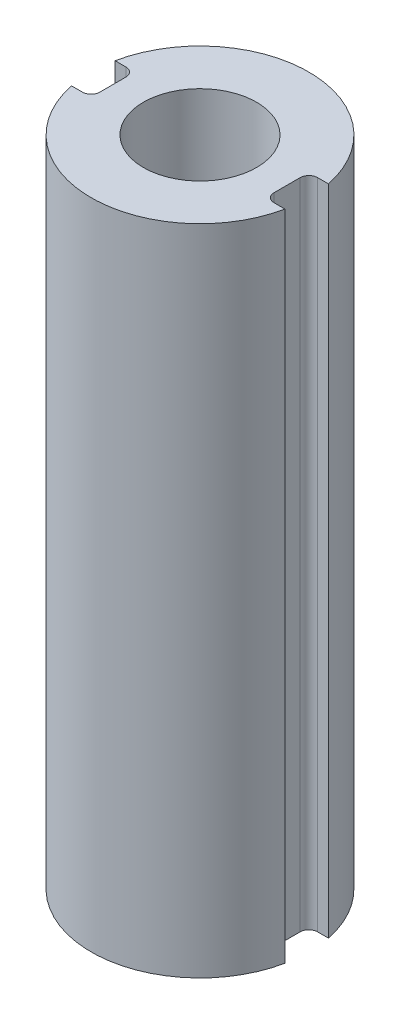
ISO-10303-21;
HEADER;
FILE_DESCRIPTION(('STEP AP214'),'2;1');
FILE_NAME('part.step','',(''),(''),'','','');
FILE_SCHEMA(('AUTOMOTIVE_DESIGN { 1 0 10303 214 1 1 1 1 }'));
ENDSEC;
DATA;
#1=APPLICATION_CONTEXT('core data for automotive mechanical design processes');
#2=APPLICATION_PROTOCOL_DEFINITION('international standard','automotive_design',2000,#1);
#3=PRODUCT_CONTEXT('',#1,'mechanical');
#4=PRODUCT('Part','Part','',(#3));
#5=PRODUCT_RELATED_PRODUCT_CATEGORY('part','',(#4));
#6=PRODUCT_DEFINITION_FORMATION('','',#4);
#7=PRODUCT_DEFINITION_CONTEXT('part definition',#1,'design');
#8=PRODUCT_DEFINITION('design','',#6,#7);
#9=PRODUCT_DEFINITION_SHAPE('','',#8);
#10=(LENGTH_UNIT() NAMED_UNIT(*) SI_UNIT(.MILLI.,.METRE.));
#11=(NAMED_UNIT(*) PLANE_ANGLE_UNIT() SI_UNIT($,.RADIAN.));
#12=(NAMED_UNIT(*) SI_UNIT($,.STERADIAN.) SOLID_ANGLE_UNIT());
#13=UNCERTAINTY_MEASURE_WITH_UNIT(LENGTH_MEASURE(1.E-05),#10,'distance_accuracy_value','');
#14=(GEOMETRIC_REPRESENTATION_CONTEXT(3) GLOBAL_UNCERTAINTY_ASSIGNED_CONTEXT((#13)) GLOBAL_UNIT_ASSIGNED_CONTEXT((#10,
#11,#12)) REPRESENTATION_CONTEXT('',''));
#15=CARTESIAN_POINT('',(0.,0.,0.));
#16=DIRECTION('',(0.,0.,1.));
#17=DIRECTION('',(1.,0.,0.));
#18=AXIS2_PLACEMENT_3D('',#15,#16,#17);
#19=CARTESIAN_POINT('',(2.54,19.05,0.634999999999999));
#20=DIRECTION('',(-1.,0.,0.));
#21=DIRECTION('',(0.,0.,1.));
#22=AXIS2_PLACEMENT_3D('',#19,#20,#21);
#23=PLANE('',#22);
#24=DIRECTION('',(0.,0.,-1.));
#25=VECTOR('',#24,1.);
#26=CARTESIAN_POINT('',(2.54,19.05,0.634999999999999));
#27=LINE('',#26,#25);
#28=CARTESIAN_POINT('',(2.54,19.05,0.381));
#29=VERTEX_POINT('',#28);
#30=CARTESIAN_POINT('',(2.54,19.05,-0.381000000000001));
#31=VERTEX_POINT('',#30);
#32=EDGE_CURVE('E136',#29,#31,#27,.T.);
#33=ORIENTED_EDGE('',*,*,#32,.F.);
#34=DIRECTION('',(0.,-1.,0.));
#35=VECTOR('',#34,1.);
#36=CARTESIAN_POINT('',(2.54,0.,0.381));
#37=LINE('',#36,#35);
#38=CARTESIAN_POINT('',(2.54,0.,0.381));
#39=VERTEX_POINT('',#38);
#40=EDGE_CURVE('E191',#29,#39,#37,.T.);
#41=ORIENTED_EDGE('',*,*,#40,.T.);
#42=DIRECTION('',(0.,0.,-1.));
#43=VECTOR('',#42,1.);
#44=CARTESIAN_POINT('',(2.54,0.,0.634999999999999));
#45=LINE('',#44,#43);
#46=CARTESIAN_POINT('',(2.54,0.,-0.381000000000001));
#47=VERTEX_POINT('',#46);
#48=EDGE_CURVE('E165',#39,#47,#45,.T.);
#49=ORIENTED_EDGE('',*,*,#48,.T.);
#50=DIRECTION('',(0.,-1.,0.));
#51=VECTOR('',#50,1.);
#52=CARTESIAN_POINT('',(2.54,19.05,-0.381000000000001));
#53=LINE('',#52,#51);
#54=EDGE_CURVE('E145',#47,#31,#53,.F.);
#55=ORIENTED_EDGE('',*,*,#54,.T.);
#56=EDGE_LOOP('',(#33,#41,#49,#55));
#57=FACE_BOUND('',#56,.T.);
#58=ADVANCED_FACE('F35',(#57),#23,.F.);
#59=CARTESIAN_POINT('',(2.54,19.05,-0.635000000000001));
#60=DIRECTION('',(0.,0.,-1.));
#61=DIRECTION('',(-1.,0.,0.));
#62=AXIS2_PLACEMENT_3D('',#59,#60,#61);
#63=PLANE('',#62);
#64=DIRECTION('',(1.,0.,0.));
#65=VECTOR('',#64,1.);
#66=CARTESIAN_POINT('',(2.54,19.05,-0.635000000000001));
#67=LINE('',#66,#65);
#68=CARTESIAN_POINT('',(2.794,19.05,-0.635000000000001));
#69=VERTEX_POINT('',#68);
#70=CARTESIAN_POINT('',(3.11085197333464,19.05,-0.635000000000001));
#71=VERTEX_POINT('',#70);
#72=EDGE_CURVE('E123',#69,#71,#67,.T.);
#73=ORIENTED_EDGE('',*,*,#72,.F.);
#74=DIRECTION('',(0.,-1.,0.));
#75=VECTOR('',#74,1.);
#76=CARTESIAN_POINT('',(2.794,0.,-0.635000000000001));
#77=LINE('',#76,#75);
#78=CARTESIAN_POINT('',(2.794,0.,-0.635000000000001));
#79=VERTEX_POINT('',#78);
#80=EDGE_CURVE('E196',#69,#79,#77,.T.);
#81=ORIENTED_EDGE('',*,*,#80,.T.);
#82=DIRECTION('',(1.,0.,0.));
#83=VECTOR('',#82,1.);
#84=CARTESIAN_POINT('',(2.54,0.,-0.635000000000001));
#85=LINE('',#84,#83);
#86=CARTESIAN_POINT('',(3.11085197333464,0.,-0.635000000000001));
#87=VERTEX_POINT('',#86);
#88=EDGE_CURVE('E142',#79,#87,#85,.T.);
#89=ORIENTED_EDGE('',*,*,#88,.T.);
#90=DIRECTION('',(0.,-1.,0.));
#91=VECTOR('',#90,1.);
#92=CARTESIAN_POINT('',(3.11085197333464,19.05,-0.635000000000001));
#93=LINE('',#92,#91);
#94=EDGE_CURVE('E139',#71,#87,#93,.T.);
#95=ORIENTED_EDGE('',*,*,#94,.F.);
#96=EDGE_LOOP('',(#73,#81,#89,#95));
#97=FACE_BOUND('',#96,.T.);
#98=ADVANCED_FACE('F140',(#97),#63,.F.);
#99=CARTESIAN_POINT('',(0.,19.05,0.));
#100=DIRECTION('',(0.,-1.,0.));
#101=DIRECTION('',(0.,0.,-1.));
#102=AXIS2_PLACEMENT_3D('',#99,#100,#101);
#103=CYLINDRICAL_SURFACE('',#102,3.175);
#104=CARTESIAN_POINT('',(0.,0.,0.));
#105=DIRECTION('',(0.,1.,0.));
#106=DIRECTION('',(0.,0.,1.));
#107=AXIS2_PLACEMENT_3D('',#104,#105,#106);
#108=CIRCLE('',#107,3.175);
#109=CARTESIAN_POINT('',(-3.11085197333464,0.,-0.635000000000001));
#110=VERTEX_POINT('',#109);
#111=EDGE_CURVE('E170',#87,#110,#108,.T.);
#112=ORIENTED_EDGE('',*,*,#111,.T.);
#113=DIRECTION('',(0.,-1.,0.));
#114=VECTOR('',#113,1.);
#115=CARTESIAN_POINT('',(-3.11085197333464,19.05,-0.635000000000001));
#116=LINE('',#115,#114);
#117=CARTESIAN_POINT('',(-3.11085197333464,19.05,-0.635000000000001));
#118=VERTEX_POINT('',#117);
#119=EDGE_CURVE('E146',#118,#110,#116,.T.);
#120=ORIENTED_EDGE('',*,*,#119,.F.);
#121=CARTESIAN_POINT('',(0.,19.05,0.));
#122=DIRECTION('',(0.,1.,0.));
#123=DIRECTION('',(0.,0.,1.));
#124=AXIS2_PLACEMENT_3D('',#121,#122,#123);
#125=CIRCLE('',#124,3.175);
#126=EDGE_CURVE('E128',#71,#118,#125,.T.);
#127=ORIENTED_EDGE('',*,*,#126,.F.);
#128=ORIENTED_EDGE('',*,*,#94,.T.);
#129=EDGE_LOOP('',(#112,#120,#127,#128));
#130=FACE_BOUND('',#129,.T.);
#131=ADVANCED_FACE('F148',(#130),#103,.T.);
#132=CARTESIAN_POINT('',(-2.54,19.05,-0.635000000000001));
#133=DIRECTION('',(0.,0.,-1.));
#134=DIRECTION('',(-1.,0.,0.));
#135=AXIS2_PLACEMENT_3D('',#132,#133,#134);
#136=PLANE('',#135);
#137=DIRECTION('',(1.,0.,0.));
#138=VECTOR('',#137,1.);
#139=CARTESIAN_POINT('',(-2.54,0.,-0.635000000000001));
#140=LINE('',#139,#138);
#141=CARTESIAN_POINT('',(-2.794,0.,-0.635000000000001));
#142=VERTEX_POINT('',#141);
#143=EDGE_CURVE('E172',#110,#142,#140,.T.);
#144=ORIENTED_EDGE('',*,*,#143,.T.);
#145=DIRECTION('',(0.,-1.,0.));
#146=VECTOR('',#145,1.);
#147=CARTESIAN_POINT('',(-2.794,19.05,-0.635000000000001));
#148=LINE('',#147,#146);
#149=CARTESIAN_POINT('',(-2.794,19.05,-0.635000000000001));
#150=VERTEX_POINT('',#149);
#151=EDGE_CURVE('E50',#142,#150,#148,.F.);
#152=ORIENTED_EDGE('',*,*,#151,.T.);
#153=DIRECTION('',(1.,0.,0.));
#154=VECTOR('',#153,1.);
#155=CARTESIAN_POINT('',(-2.54,19.05,-0.635000000000001));
#156=LINE('',#155,#154);
#157=EDGE_CURVE('E150',#118,#150,#156,.T.);
#158=ORIENTED_EDGE('',*,*,#157,.F.);
#159=ORIENTED_EDGE('',*,*,#119,.T.);
#160=EDGE_LOOP('',(#144,#152,#158,#159));
#161=FACE_BOUND('',#160,.T.);
#162=ADVANCED_FACE('F237',(#161),#136,.F.);
#163=CARTESIAN_POINT('',(-2.54,19.05,0.634999999999999));
#164=DIRECTION('',(1.,0.,0.));
#165=DIRECTION('',(0.,0.,-1.));
#166=AXIS2_PLACEMENT_3D('',#163,#164,#165);
#167=PLANE('',#166);
#168=DIRECTION('',(0.,0.,1.));
#169=VECTOR('',#168,1.);
#170=CARTESIAN_POINT('',(-2.54,0.,0.634999999999999));
#171=LINE('',#170,#169);
#172=CARTESIAN_POINT('',(-2.54,0.,-0.381000000000001));
#173=VERTEX_POINT('',#172);
#174=CARTESIAN_POINT('',(-2.54,0.,0.380999999999999));
#175=VERTEX_POINT('',#174);
#176=EDGE_CURVE('E174',#173,#175,#171,.T.);
#177=ORIENTED_EDGE('',*,*,#176,.T.);
#178=DIRECTION('',(0.,-1.,0.));
#179=VECTOR('',#178,1.);
#180=CARTESIAN_POINT('',(-2.54,19.05,0.380999999999999));
#181=LINE('',#180,#179);
#182=CARTESIAN_POINT('',(-2.54,19.05,0.380999999999999));
#183=VERTEX_POINT('',#182);
#184=EDGE_CURVE('E204',#175,#183,#181,.F.);
#185=ORIENTED_EDGE('',*,*,#184,.T.);
#186=DIRECTION('',(0.,0.,1.));
#187=VECTOR('',#186,1.);
#188=CARTESIAN_POINT('',(-2.54,19.05,0.634999999999999));
#189=LINE('',#188,#187);
#190=CARTESIAN_POINT('',(-2.54,19.05,-0.381000000000001));
#191=VERTEX_POINT('',#190);
#192=EDGE_CURVE('E152',#191,#183,#189,.T.);
#193=ORIENTED_EDGE('',*,*,#192,.F.);
#194=DIRECTION('',(0.,-1.,0.));
#195=VECTOR('',#194,1.);
#196=CARTESIAN_POINT('',(-2.54,0.,-0.381000000000001));
#197=LINE('',#196,#195);
#198=EDGE_CURVE('E201',#191,#173,#197,.T.);
#199=ORIENTED_EDGE('',*,*,#198,.T.);
#200=EDGE_LOOP('',(#177,#185,#193,#199));
#201=FACE_BOUND('',#200,.T.);
#202=ADVANCED_FACE('F233',(#201),#167,.F.);
#203=CARTESIAN_POINT('',(-2.54,19.05,0.634999999999999));
#204=DIRECTION('',(0.,0.,1.));
#205=DIRECTION('',(1.,0.,0.));
#206=AXIS2_PLACEMENT_3D('',#203,#204,#205);
#207=PLANE('',#206);
#208=DIRECTION('',(-1.,0.,0.));
#209=VECTOR('',#208,1.);
#210=CARTESIAN_POINT('',(-2.54,19.05,0.634999999999999));
#211=LINE('',#210,#209);
#212=CARTESIAN_POINT('',(-2.794,19.05,0.634999999999999));
#213=VERTEX_POINT('',#212);
#214=CARTESIAN_POINT('',(-3.11085197333464,19.05,0.635));
#215=VERTEX_POINT('',#214);
#216=EDGE_CURVE('E158',#213,#215,#211,.T.);
#217=ORIENTED_EDGE('',*,*,#216,.F.);
#218=DIRECTION('',(0.,-1.,0.));
#219=VECTOR('',#218,1.);
#220=CARTESIAN_POINT('',(-2.794,0.,0.634999999999999));
#221=LINE('',#220,#219);
#222=CARTESIAN_POINT('',(-2.794,0.,0.634999999999999));
#223=VERTEX_POINT('',#222);
#224=EDGE_CURVE('E198',#213,#223,#221,.T.);
#225=ORIENTED_EDGE('',*,*,#224,.T.);
#226=DIRECTION('',(-1.,0.,0.));
#227=VECTOR('',#226,1.);
#228=CARTESIAN_POINT('',(-2.54,0.,0.634999999999999));
#229=LINE('',#228,#227);
#230=CARTESIAN_POINT('',(-3.11085197333464,0.,0.635));
#231=VERTEX_POINT('',#230);
#232=EDGE_CURVE('E177',#223,#231,#229,.T.);
#233=ORIENTED_EDGE('',*,*,#232,.T.);
#234=DIRECTION('',(0.,-1.,0.));
#235=VECTOR('',#234,1.);
#236=CARTESIAN_POINT('',(-3.11085197333464,19.05,0.635));
#237=LINE('',#236,#235);
#238=EDGE_CURVE('E186',#215,#231,#237,.T.);
#239=ORIENTED_EDGE('',*,*,#238,.F.);
#240=EDGE_LOOP('',(#217,#225,#233,#239));
#241=FACE_BOUND('',#240,.T.);
#242=ADVANCED_FACE('F225',(#241),#207,.F.);
#243=CARTESIAN_POINT('',(0.,19.05,0.));
#244=DIRECTION('',(0.,-1.,0.));
#245=DIRECTION('',(0.,0.,-1.));
#246=AXIS2_PLACEMENT_3D('',#243,#244,#245);
#247=CYLINDRICAL_SURFACE('',#246,3.175);
#248=CARTESIAN_POINT('',(0.,0.,0.));
#249=DIRECTION('',(0.,1.,0.));
#250=DIRECTION('',(0.,0.,1.));
#251=AXIS2_PLACEMENT_3D('',#248,#249,#250);
#252=CIRCLE('',#251,3.175);
#253=CARTESIAN_POINT('',(3.11085197333464,0.,0.634999999999999));
#254=VERTEX_POINT('',#253);
#255=EDGE_CURVE('E179',#231,#254,#252,.T.);
#256=ORIENTED_EDGE('',*,*,#255,.T.);
#257=DIRECTION('',(0.,-1.,0.));
#258=VECTOR('',#257,1.);
#259=CARTESIAN_POINT('',(3.11085197333464,19.05,0.634999999999999));
#260=LINE('',#259,#258);
#261=CARTESIAN_POINT('',(3.11085197333464,19.05,0.634999999999999));
#262=VERTEX_POINT('',#261);
#263=EDGE_CURVE('E164',#262,#254,#260,.T.);
#264=ORIENTED_EDGE('',*,*,#263,.F.);
#265=CARTESIAN_POINT('',(0.,19.05,0.));
#266=DIRECTION('',(0.,1.,0.));
#267=DIRECTION('',(0.,0.,1.));
#268=AXIS2_PLACEMENT_3D('',#265,#266,#267);
#269=CIRCLE('',#268,3.175);
#270=EDGE_CURVE('E160',#215,#262,#269,.T.);
#271=ORIENTED_EDGE('',*,*,#270,.F.);
#272=ORIENTED_EDGE('',*,*,#238,.T.);
#273=EDGE_LOOP('',(#256,#264,#271,#272));
#274=FACE_BOUND('',#273,.T.);
#275=ADVANCED_FACE('F269',(#274),#247,.T.);
#276=CARTESIAN_POINT('',(2.54,19.05,0.634999999999999));
#277=DIRECTION('',(0.,0.,1.));
#278=DIRECTION('',(1.,0.,0.));
#279=AXIS2_PLACEMENT_3D('',#276,#277,#278);
#280=PLANE('',#279);
#281=DIRECTION('',(-1.,0.,0.));
#282=VECTOR('',#281,1.);
#283=CARTESIAN_POINT('',(2.54,0.,0.634999999999999));
#284=LINE('',#283,#282);
#285=CARTESIAN_POINT('',(2.794,0.,0.634999999999999));
#286=VERTEX_POINT('',#285);
#287=EDGE_CURVE('E181',#254,#286,#284,.T.);
#288=ORIENTED_EDGE('',*,*,#287,.T.);
#289=DIRECTION('',(0.,-1.,0.));
#290=VECTOR('',#289,1.);
#291=CARTESIAN_POINT('',(2.794,19.05,0.634999999999999));
#292=LINE('',#291,#290);
#293=CARTESIAN_POINT('',(2.794,19.05,0.634999999999999));
#294=VERTEX_POINT('',#293);
#295=EDGE_CURVE('E194',#286,#294,#292,.F.);
#296=ORIENTED_EDGE('',*,*,#295,.T.);
#297=DIRECTION('',(-1.,0.,0.));
#298=VECTOR('',#297,1.);
#299=CARTESIAN_POINT('',(2.54,19.05,0.634999999999999));
#300=LINE('',#299,#298);
#301=EDGE_CURVE('E162',#262,#294,#300,.T.);
#302=ORIENTED_EDGE('',*,*,#301,.F.);
#303=ORIENTED_EDGE('',*,*,#263,.T.);
#304=EDGE_LOOP('',(#288,#296,#302,#303));
#305=FACE_BOUND('',#304,.T.);
#306=ADVANCED_FACE('F272',(#305),#280,.F.);
#307=CARTESIAN_POINT('',(0.,19.05,0.));
#308=DIRECTION('',(0.,1.,0.));
#309=DIRECTION('',(0.,0.,1.));
#310=AXIS2_PLACEMENT_3D('',#307,#308,#309);
#311=PLANE('',#310);
#312=CARTESIAN_POINT('',(0.,19.05,0.));
#313=DIRECTION('',(0.,1.,0.));
#314=DIRECTION('',(0.,0.,1.));
#315=AXIS2_PLACEMENT_3D('',#312,#313,#314);
#316=CIRCLE('',#315,1.651);
#317=CARTESIAN_POINT('',(0.,19.05,1.651));
#318=VERTEX_POINT('',#317);
#319=EDGE_CURVE('E292',#318,#318,#316,.T.);
#320=ORIENTED_EDGE('',*,*,#319,.F.);
#321=EDGE_LOOP('',(#320));
#322=FACE_BOUND('',#321,.T.);
#323=ORIENTED_EDGE('',*,*,#301,.T.);
#324=CARTESIAN_POINT('',(2.794,19.05,0.381));
#325=DIRECTION('',(0.,1.,0.));
#326=DIRECTION('',(0.,0.,1.));
#327=AXIS2_PLACEMENT_3D('',#324,#325,#326);
#328=CIRCLE('',#327,0.254);
#329=EDGE_CURVE('E209',#294,#29,#328,.F.);
#330=ORIENTED_EDGE('',*,*,#329,.T.);
#331=ORIENTED_EDGE('',*,*,#32,.T.);
#332=CARTESIAN_POINT('',(2.794,19.05,-0.381000000000001));
#333=DIRECTION('',(0.,1.,0.));
#334=DIRECTION('',(0.,0.,1.));
#335=AXIS2_PLACEMENT_3D('',#332,#333,#334);
#336=CIRCLE('',#335,0.254);
#337=EDGE_CURVE('E132',#31,#69,#336,.F.);
#338=ORIENTED_EDGE('',*,*,#337,.T.);
#339=ORIENTED_EDGE('',*,*,#72,.T.);
#340=ORIENTED_EDGE('',*,*,#126,.T.);
#341=ORIENTED_EDGE('',*,*,#157,.T.);
#342=CARTESIAN_POINT('',(-2.794,19.05,-0.381000000000001));
#343=DIRECTION('',(0.,1.,0.));
#344=DIRECTION('',(0.,0.,1.));
#345=AXIS2_PLACEMENT_3D('',#342,#343,#344);
#346=CIRCLE('',#345,0.254);
#347=EDGE_CURVE('E11',#150,#191,#346,.F.);
#348=ORIENTED_EDGE('',*,*,#347,.T.);
#349=ORIENTED_EDGE('',*,*,#192,.T.);
#350=CARTESIAN_POINT('',(-2.794,19.05,0.380999999999999));
#351=DIRECTION('',(0.,1.,0.));
#352=DIRECTION('',(0.,0.,1.));
#353=AXIS2_PLACEMENT_3D('',#350,#351,#352);
#354=CIRCLE('',#353,0.254);
#355=EDGE_CURVE('E216',#183,#213,#354,.F.);
#356=ORIENTED_EDGE('',*,*,#355,.T.);
#357=ORIENTED_EDGE('',*,*,#216,.T.);
#358=ORIENTED_EDGE('',*,*,#270,.T.);
#359=EDGE_LOOP('',(#323,#330,#331,#338,#339,#340,#341,#348,#349,#356,#357,#358));
#360=FACE_BOUND('',#359,.T.);
#361=ADVANCED_FACE('F126',(#322,#360),#311,.T.);
#362=CARTESIAN_POINT('',(0.,0.,0.));
#363=DIRECTION('',(0.,1.,0.));
#364=DIRECTION('',(0.,0.,1.));
#365=AXIS2_PLACEMENT_3D('',#362,#363,#364);
#366=PLANE('',#365);
#367=ORIENTED_EDGE('',*,*,#48,.F.);
#368=CARTESIAN_POINT('',(2.794,0.,0.381));
#369=DIRECTION('',(0.,1.,0.));
#370=DIRECTION('',(0.,0.,1.));
#371=AXIS2_PLACEMENT_3D('',#368,#369,#370);
#372=CIRCLE('',#371,0.254);
#373=EDGE_CURVE('E207',#39,#286,#372,.T.);
#374=ORIENTED_EDGE('',*,*,#373,.T.);
#375=ORIENTED_EDGE('',*,*,#287,.F.);
#376=ORIENTED_EDGE('',*,*,#255,.F.);
#377=ORIENTED_EDGE('',*,*,#232,.F.);
#378=CARTESIAN_POINT('',(-2.794,0.,0.380999999999999));
#379=DIRECTION('',(0.,1.,0.));
#380=DIRECTION('',(0.,0.,1.));
#381=AXIS2_PLACEMENT_3D('',#378,#379,#380);
#382=CIRCLE('',#381,0.254);
#383=EDGE_CURVE('E214',#223,#175,#382,.T.);
#384=ORIENTED_EDGE('',*,*,#383,.T.);
#385=ORIENTED_EDGE('',*,*,#176,.F.);
#386=CARTESIAN_POINT('',(-2.794,0.,-0.381000000000001));
#387=DIRECTION('',(0.,1.,0.));
#388=DIRECTION('',(0.,0.,1.));
#389=AXIS2_PLACEMENT_3D('',#386,#387,#388);
#390=CIRCLE('',#389,0.254);
#391=EDGE_CURVE('E43',#173,#142,#390,.T.);
#392=ORIENTED_EDGE('',*,*,#391,.T.);
#393=ORIENTED_EDGE('',*,*,#143,.F.);
#394=ORIENTED_EDGE('',*,*,#111,.F.);
#395=ORIENTED_EDGE('',*,*,#88,.F.);
#396=CARTESIAN_POINT('',(2.794,0.,-0.381000000000001));
#397=DIRECTION('',(0.,1.,0.));
#398=DIRECTION('',(0.,0.,1.));
#399=AXIS2_PLACEMENT_3D('',#396,#397,#398);
#400=CIRCLE('',#399,0.254);
#401=EDGE_CURVE('E211',#79,#47,#400,.T.);
#402=ORIENTED_EDGE('',*,*,#401,.T.);
#403=EDGE_LOOP('',(#367,#374,#375,#376,#377,#384,#385,#392,#393,#394,#395,#402));
#404=FACE_BOUND('',#403,.T.);
#405=ADVANCED_FACE('F230',(#404),#366,.F.);
#406=CARTESIAN_POINT('',(0.,6.35,0.));
#407=DIRECTION('',(0.,1.,0.));
#408=DIRECTION('',(0.,0.,1.));
#409=AXIS2_PLACEMENT_3D('',#406,#407,#408);
#410=CYLINDRICAL_SURFACE('',#409,1.651);
#411=CARTESIAN_POINT('',(0.,6.35,0.));
#412=DIRECTION('',(0.,1.,0.));
#413=DIRECTION('',(0.,0.,1.));
#414=AXIS2_PLACEMENT_3D('',#411,#412,#413);
#415=CIRCLE('',#414,1.651);
#416=CARTESIAN_POINT('',(0.,6.35,1.651));
#417=VERTEX_POINT('',#416);
#418=EDGE_CURVE('E168',#417,#417,#415,.T.);
#419=ORIENTED_EDGE('',*,*,#418,.F.);
#420=EDGE_LOOP('',(#419));
#421=FACE_BOUND('',#420,.T.);
#422=ORIENTED_EDGE('',*,*,#319,.T.);
#423=EDGE_LOOP('',(#422));
#424=FACE_BOUND('',#423,.T.);
#425=ADVANCED_FACE('F279',(#421,#424),#410,.F.);
#426=CARTESIAN_POINT('',(0.,6.35,0.));
#427=DIRECTION('',(0.,1.,0.));
#428=DIRECTION('',(0.,0.,1.));
#429=AXIS2_PLACEMENT_3D('',#426,#427,#428);
#430=PLANE('',#429);
#431=ORIENTED_EDGE('',*,*,#418,.T.);
#432=EDGE_LOOP('',(#431));
#433=FACE_BOUND('',#432,.T.);
#434=ADVANCED_FACE('F251',(#433),#430,.T.);
#435=CARTESIAN_POINT('',(2.794,19.05,0.381));
#436=DIRECTION('',(0.,1.,0.));
#437=DIRECTION('',(0.,0.,1.));
#438=AXIS2_PLACEMENT_3D('',#435,#436,#437);
#439=CYLINDRICAL_SURFACE('',#438,0.254);
#440=ORIENTED_EDGE('',*,*,#329,.F.);
#441=ORIENTED_EDGE('',*,*,#295,.F.);
#442=ORIENTED_EDGE('',*,*,#373,.F.);
#443=ORIENTED_EDGE('',*,*,#40,.F.);
#444=EDGE_LOOP('',(#440,#441,#442,#443));
#445=FACE_BOUND('',#444,.T.);
#446=ADVANCED_FACE('F245',(#445),#439,.F.);
#447=CARTESIAN_POINT('',(2.794,19.05,-0.381000000000001));
#448=DIRECTION('',(0.,1.,0.));
#449=DIRECTION('',(0.,0.,1.));
#450=AXIS2_PLACEMENT_3D('',#447,#448,#449);
#451=CYLINDRICAL_SURFACE('',#450,0.254);
#452=ORIENTED_EDGE('',*,*,#337,.F.);
#453=ORIENTED_EDGE('',*,*,#54,.F.);
#454=ORIENTED_EDGE('',*,*,#401,.F.);
#455=ORIENTED_EDGE('',*,*,#80,.F.);
#456=EDGE_LOOP('',(#452,#453,#454,#455));
#457=FACE_BOUND('',#456,.T.);
#458=ADVANCED_FACE('F243',(#457),#451,.F.);
#459=CARTESIAN_POINT('',(-2.794,19.05,0.380999999999999));
#460=DIRECTION('',(0.,1.,0.));
#461=DIRECTION('',(0.,0.,1.));
#462=AXIS2_PLACEMENT_3D('',#459,#460,#461);
#463=CYLINDRICAL_SURFACE('',#462,0.254);
#464=ORIENTED_EDGE('',*,*,#355,.F.);
#465=ORIENTED_EDGE('',*,*,#184,.F.);
#466=ORIENTED_EDGE('',*,*,#383,.F.);
#467=ORIENTED_EDGE('',*,*,#224,.F.);
#468=EDGE_LOOP('',(#464,#465,#466,#467));
#469=FACE_BOUND('',#468,.T.);
#470=ADVANCED_FACE('F228',(#469),#463,.F.);
#471=CARTESIAN_POINT('',(-2.794,19.05,-0.381000000000001));
#472=DIRECTION('',(0.,1.,0.));
#473=DIRECTION('',(0.,0.,1.));
#474=AXIS2_PLACEMENT_3D('',#471,#472,#473);
#475=CYLINDRICAL_SURFACE('',#474,0.254);
#476=ORIENTED_EDGE('',*,*,#347,.F.);
#477=ORIENTED_EDGE('',*,*,#151,.F.);
#478=ORIENTED_EDGE('',*,*,#391,.F.);
#479=ORIENTED_EDGE('',*,*,#198,.F.);
#480=EDGE_LOOP('',(#476,#477,#478,#479));
#481=FACE_BOUND('',#480,.T.);
#482=ADVANCED_FACE('F37',(#481),#475,.F.);
#483=CLOSED_SHELL('',(#58,#98,#131,#162,#202,#242,#275,#306,#361,#405,#425,#434,#446,#458,#470,#482));
#484=MANIFOLD_SOLID_BREP('B2',#483);
#485=ADVANCED_BREP_SHAPE_REPRESENTATION('',(#18,#484),#14);
#486=SHAPE_DEFINITION_REPRESENTATION(#9,#485);
ENDSEC;
END-ISO-10303-21;
